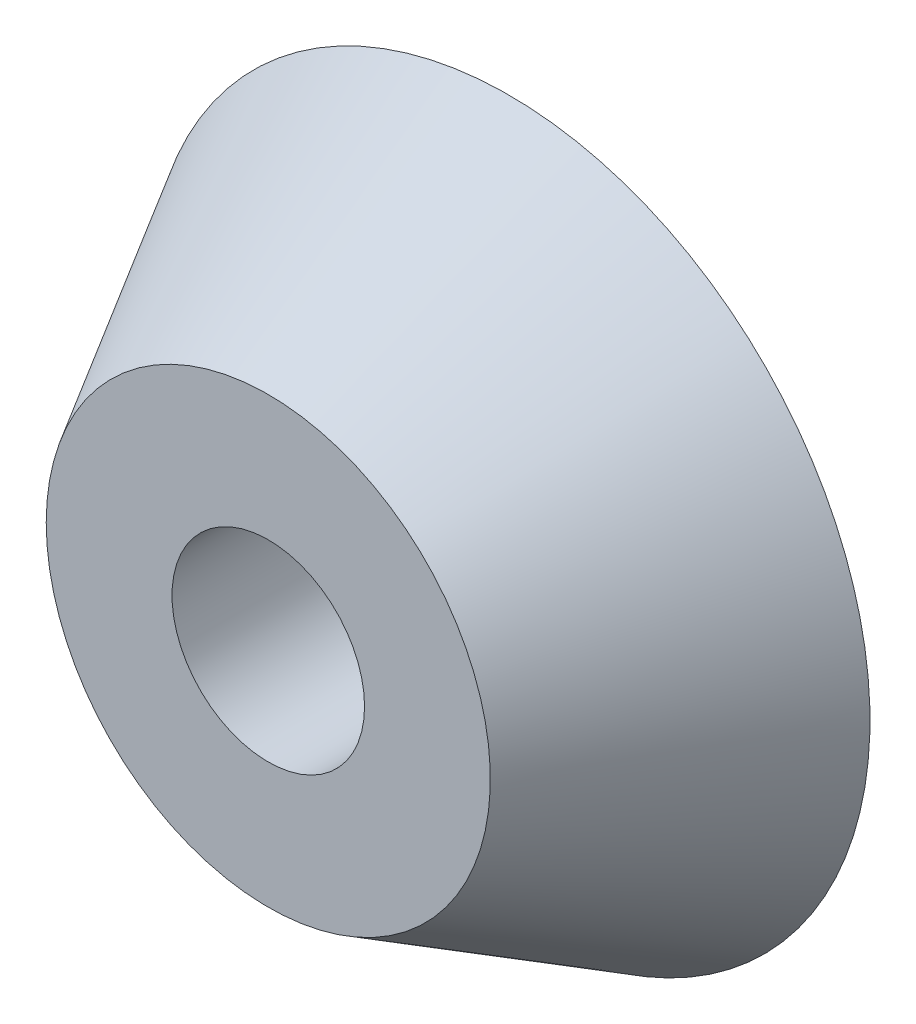
ISO-10303-21;
HEADER;
FILE_DESCRIPTION(('STEP AP214'),'2;1');
FILE_NAME('part.step','',(''),(''),'','','');
FILE_SCHEMA(('AUTOMOTIVE_DESIGN { 1 0 10303 214 1 1 1 1 }'));
ENDSEC;
DATA;
#1=APPLICATION_CONTEXT('core data for automotive mechanical design processes');
#2=APPLICATION_PROTOCOL_DEFINITION('international standard','automotive_design',2000,#1);
#3=PRODUCT_CONTEXT('',#1,'mechanical');
#4=PRODUCT('Part','Part','',(#3));
#5=PRODUCT_RELATED_PRODUCT_CATEGORY('part','',(#4));
#6=PRODUCT_DEFINITION_FORMATION('','',#4);
#7=PRODUCT_DEFINITION_CONTEXT('part definition',#1,'design');
#8=PRODUCT_DEFINITION('design','',#6,#7);
#9=PRODUCT_DEFINITION_SHAPE('','',#8);
#10=(LENGTH_UNIT() NAMED_UNIT(*) SI_UNIT(.MILLI.,.METRE.));
#11=(NAMED_UNIT(*) PLANE_ANGLE_UNIT() SI_UNIT($,.RADIAN.));
#12=(NAMED_UNIT(*) SI_UNIT($,.STERADIAN.) SOLID_ANGLE_UNIT());
#13=UNCERTAINTY_MEASURE_WITH_UNIT(LENGTH_MEASURE(1.E-05),#10,'distance_accuracy_value','');
#14=(GEOMETRIC_REPRESENTATION_CONTEXT(3) GLOBAL_UNCERTAINTY_ASSIGNED_CONTEXT((#13)) GLOBAL_UNIT_ASSIGNED_CONTEXT((#10,
#11,#12)) REPRESENTATION_CONTEXT('',''));
#15=CARTESIAN_POINT('',(0.,0.,0.));
#16=DIRECTION('',(0.,0.,1.));
#17=DIRECTION('',(1.,0.,0.));
#18=AXIS2_PLACEMENT_3D('',#15,#16,#17);
#19=CARTESIAN_POINT('',(0.,0.,0.));
#20=DIRECTION('',(0.,0.,-1.));
#21=DIRECTION('',(-1.,0.,0.));
#22=AXIS2_PLACEMENT_3D('',#19,#20,#21);
#23=PLANE('',#22);
#24=CARTESIAN_POINT('',(0.,0.,0.));
#25=DIRECTION('',(0.,0.,1.));
#26=DIRECTION('',(1.,0.,0.));
#27=AXIS2_PLACEMENT_3D('',#24,#25,#26);
#28=CIRCLE('',#27,10.);
#29=CARTESIAN_POINT('',(10.,0.,0.));
#30=VERTEX_POINT('',#29);
#31=EDGE_CURVE('E57',#30,#30,#28,.T.);
#32=ORIENTED_EDGE('',*,*,#31,.F.);
#33=EDGE_LOOP('',(#32));
#34=FACE_BOUND('',#33,.T.);
#35=CARTESIAN_POINT('',(0.,0.,0.));
#36=DIRECTION('',(0.,0.,-1.));
#37=DIRECTION('',(-1.,0.,0.));
#38=AXIS2_PLACEMENT_3D('',#35,#36,#37);
#39=CIRCLE('',#38,23.0662432702592);
#40=CARTESIAN_POINT('',(-23.0662432702592,0.,0.));
#41=VERTEX_POINT('',#40);
#42=EDGE_CURVE('E10',#41,#41,#39,.T.);
#43=ORIENTED_EDGE('',*,*,#42,.F.);
#44=EDGE_LOOP('',(#43));
#45=FACE_BOUND('',#44,.T.);
#46=ADVANCED_FACE('F40',(#34,#45),#23,.F.);
#47=CARTESIAN_POINT('',(0.,0.,0.));
#48=DIRECTION('',(0.,0.,-1.));
#49=DIRECTION('',(-1.,0.,0.));
#50=AXIS2_PLACEMENT_3D('',#47,#48,#49);
#51=CONICAL_SURFACE('',#50,23.0662432702592,0.523598775598303);
#52=CARTESIAN_POINT('',(0.,0.,-25.));
#53=DIRECTION('',(0.,0.,-1.));
#54=DIRECTION('',(-1.,0.,0.));
#55=AXIS2_PLACEMENT_3D('',#52,#53,#54);
#56=CIRCLE('',#55,37.5);
#57=CARTESIAN_POINT('',(-37.5,0.,-25.));
#58=VERTEX_POINT('',#57);
#59=EDGE_CURVE('E47',#58,#58,#56,.T.);
#60=ORIENTED_EDGE('',*,*,#59,.F.);
#61=EDGE_LOOP('',(#60));
#62=FACE_BOUND('',#61,.T.);
#63=ORIENTED_EDGE('',*,*,#42,.T.);
#64=EDGE_LOOP('',(#63));
#65=FACE_BOUND('',#64,.T.);
#66=ADVANCED_FACE('F68',(#62,#65),#51,.T.);
#67=CARTESIAN_POINT('',(37.5,0.,-25.));
#68=DIRECTION('',(0.,0.,1.));
#69=DIRECTION('',(1.,0.,0.));
#70=AXIS2_PLACEMENT_3D('',#67,#68,#69);
#71=PLANE('',#70);
#72=CARTESIAN_POINT('',(0.,0.,-25.));
#73=DIRECTION('',(0.,0.,1.));
#74=DIRECTION('',(1.,0.,0.));
#75=AXIS2_PLACEMENT_3D('',#72,#73,#74);
#76=CIRCLE('',#75,10.);
#77=CARTESIAN_POINT('',(10.,0.,-25.));
#78=VERTEX_POINT('',#77);
#79=EDGE_CURVE('E52',#78,#78,#76,.T.);
#80=ORIENTED_EDGE('',*,*,#79,.T.);
#81=EDGE_LOOP('',(#80));
#82=FACE_BOUND('',#81,.T.);
#83=ORIENTED_EDGE('',*,*,#59,.T.);
#84=EDGE_LOOP('',(#83));
#85=FACE_BOUND('',#84,.T.);
#86=ADVANCED_FACE('F74',(#82,#85),#71,.F.);
#87=CARTESIAN_POINT('',(0.,0.,-25.));
#88=DIRECTION('',(0.,0.,1.));
#89=DIRECTION('',(1.,0.,0.));
#90=AXIS2_PLACEMENT_3D('',#87,#88,#89);
#91=CYLINDRICAL_SURFACE('',#90,10.);
#92=ORIENTED_EDGE('',*,*,#79,.F.);
#93=EDGE_LOOP('',(#92));
#94=FACE_BOUND('',#93,.T.);
#95=ORIENTED_EDGE('',*,*,#31,.T.);
#96=EDGE_LOOP('',(#95));
#97=FACE_BOUND('',#96,.T.);
#98=ADVANCED_FACE('F64',(#94,#97),#91,.F.);
#99=CLOSED_SHELL('',(#46,#66,#86,#98));
#100=MANIFOLD_SOLID_BREP('B2',#99);
#101=ADVANCED_BREP_SHAPE_REPRESENTATION('',(#18,#100),#14);
#102=SHAPE_DEFINITION_REPRESENTATION(#9,#101);
ENDSEC;
END-ISO-10303-21;
